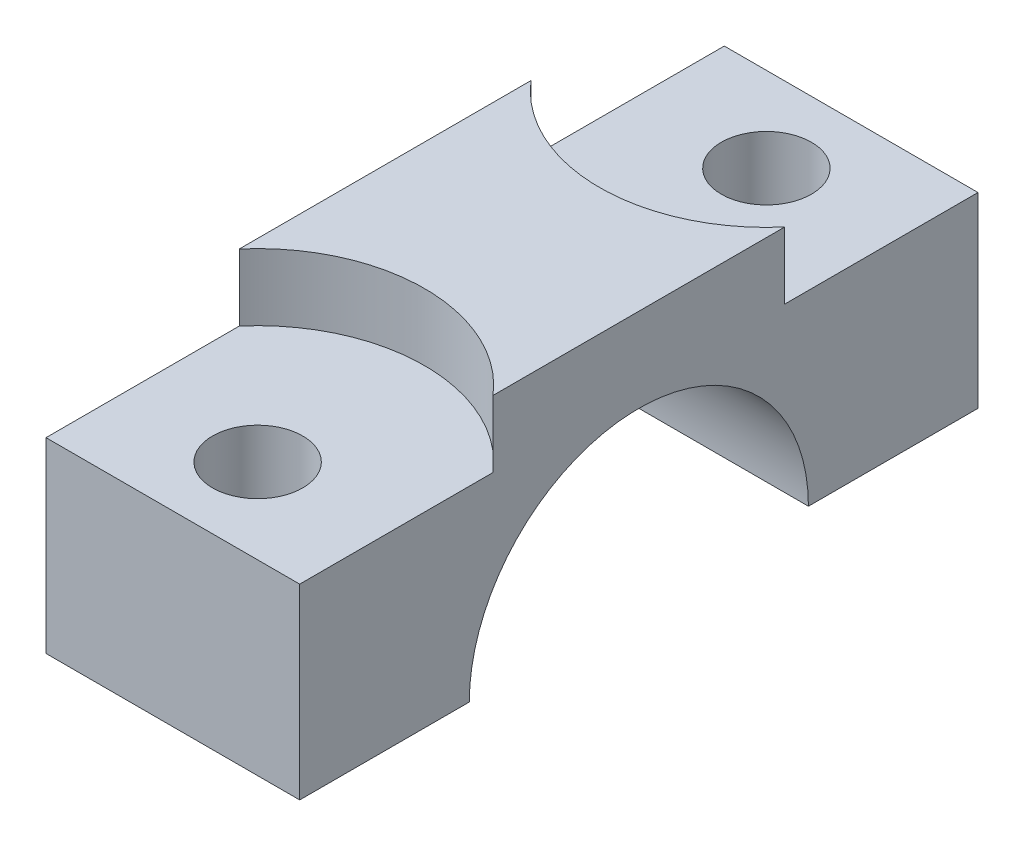
ISO-10303-21;
HEADER;
FILE_DESCRIPTION(('STEP AP214'),'2;1');
FILE_NAME('part.step','',(''),(''),'','','');
FILE_SCHEMA(('AUTOMOTIVE_DESIGN { 1 0 10303 214 1 1 1 1 }'));
ENDSEC;
DATA;
#1=APPLICATION_CONTEXT('core data for automotive mechanical design processes');
#2=APPLICATION_PROTOCOL_DEFINITION('international standard','automotive_design',2000,#1);
#3=PRODUCT_CONTEXT('',#1,'mechanical');
#4=PRODUCT('Part','Part','',(#3));
#5=PRODUCT_RELATED_PRODUCT_CATEGORY('part','',(#4));
#6=PRODUCT_DEFINITION_FORMATION('','',#4);
#7=PRODUCT_DEFINITION_CONTEXT('part definition',#1,'design');
#8=PRODUCT_DEFINITION('design','',#6,#7);
#9=PRODUCT_DEFINITION_SHAPE('','',#8);
#10=(LENGTH_UNIT() NAMED_UNIT(*) SI_UNIT(.MILLI.,.METRE.));
#11=(NAMED_UNIT(*) PLANE_ANGLE_UNIT() SI_UNIT($,.RADIAN.));
#12=(NAMED_UNIT(*) SI_UNIT($,.STERADIAN.) SOLID_ANGLE_UNIT());
#13=UNCERTAINTY_MEASURE_WITH_UNIT(LENGTH_MEASURE(1.E-05),#10,'distance_accuracy_value','');
#14=(GEOMETRIC_REPRESENTATION_CONTEXT(3) GLOBAL_UNCERTAINTY_ASSIGNED_CONTEXT((#13)) GLOBAL_UNIT_ASSIGNED_CONTEXT((#10,
#11,#12)) REPRESENTATION_CONTEXT('',''));
#15=CARTESIAN_POINT('',(0.,0.,0.));
#16=DIRECTION('',(0.,0.,1.));
#17=DIRECTION('',(1.,0.,0.));
#18=AXIS2_PLACEMENT_3D('',#15,#16,#17);
#19=CARTESIAN_POINT('',(9.5,19.,25.4));
#20=DIRECTION('',(0.,-1.,0.));
#21=DIRECTION('',(0.,0.,-1.));
#22=AXIS2_PLACEMENT_3D('',#19,#20,#21);
#23=PLANE('',#22);
#24=CARTESIAN_POINT('',(0.,19.,-19.05));
#25=DIRECTION('',(0.,1.,0.));
#26=DIRECTION('',(0.,0.,1.));
#27=AXIS2_PLACEMENT_3D('',#24,#25,#26);
#28=CIRCLE('',#27,12.5);
#29=CARTESIAN_POINT('',(-9.5,19.,-10.925961595364));
#30=VERTEX_POINT('',#29);
#31=CARTESIAN_POINT('',(9.5,19.,-10.925961595364));
#32=VERTEX_POINT('',#31);
#33=EDGE_CURVE('E121',#30,#32,#28,.T.);
#34=ORIENTED_EDGE('',*,*,#33,.F.);
#35=DIRECTION('',(0.,0.,1.));
#36=VECTOR('',#35,1.);
#37=CARTESIAN_POINT('',(-9.5,19.,25.4));
#38=LINE('',#37,#36);
#39=CARTESIAN_POINT('',(-9.5,19.,10.925961595364));
#40=VERTEX_POINT('',#39);
#41=EDGE_CURVE('E176',#30,#40,#38,.T.);
#42=ORIENTED_EDGE('',*,*,#41,.T.);
#43=CARTESIAN_POINT('',(0.,19.,19.05));
#44=DIRECTION('',(0.,1.,0.));
#45=DIRECTION('',(0.,0.,1.));
#46=AXIS2_PLACEMENT_3D('',#43,#44,#45);
#47=CIRCLE('',#46,12.5);
#48=CARTESIAN_POINT('',(9.5,19.,10.925961595364));
#49=VERTEX_POINT('',#48);
#50=EDGE_CURVE('E143',#49,#40,#47,.T.);
#51=ORIENTED_EDGE('',*,*,#50,.F.);
#52=DIRECTION('',(0.,0.,1.));
#53=VECTOR('',#52,1.);
#54=CARTESIAN_POINT('',(9.5,19.,25.4));
#55=LINE('',#54,#53);
#56=EDGE_CURVE('E187',#32,#49,#55,.T.);
#57=ORIENTED_EDGE('',*,*,#56,.F.);
#58=EDGE_LOOP('',(#34,#42,#51,#57));
#59=FACE_BOUND('',#58,.T.);
#60=ADVANCED_FACE('F43',(#59),#23,.F.);
#61=CARTESIAN_POINT('',(9.5,0.,25.4));
#62=DIRECTION('',(0.,0.,-1.));
#63=DIRECTION('',(-1.,0.,0.));
#64=AXIS2_PLACEMENT_3D('',#61,#62,#63);
#65=PLANE('',#64);
#66=DIRECTION('',(0.,-1.,0.));
#67=VECTOR('',#66,1.);
#68=CARTESIAN_POINT('',(9.5,0.,25.4));
#69=LINE('',#68,#67);
#70=CARTESIAN_POINT('',(9.5,14.,25.4));
#71=VERTEX_POINT('',#70);
#72=CARTESIAN_POINT('',(9.5,0.,25.4));
#73=VERTEX_POINT('',#72);
#74=EDGE_CURVE('E172',#71,#73,#69,.T.);
#75=ORIENTED_EDGE('',*,*,#74,.F.);
#76=DIRECTION('',(-1.,0.,0.));
#77=VECTOR('',#76,1.);
#78=CARTESIAN_POINT('',(9.5,14.,25.4));
#79=LINE('',#78,#77);
#80=CARTESIAN_POINT('',(-9.5,14.,25.4));
#81=VERTEX_POINT('',#80);
#82=EDGE_CURVE('E66',#71,#81,#79,.T.);
#83=ORIENTED_EDGE('',*,*,#82,.T.);
#84=DIRECTION('',(0.,-1.,0.));
#85=VECTOR('',#84,1.);
#86=CARTESIAN_POINT('',(-9.5,0.,25.4));
#87=LINE('',#86,#85);
#88=CARTESIAN_POINT('',(-9.5,0.,25.4));
#89=VERTEX_POINT('',#88);
#90=EDGE_CURVE('E171',#81,#89,#87,.T.);
#91=ORIENTED_EDGE('',*,*,#90,.T.);
#92=DIRECTION('',(-1.,0.,0.));
#93=VECTOR('',#92,1.);
#94=CARTESIAN_POINT('',(9.5,0.,25.4));
#95=LINE('',#94,#93);
#96=EDGE_CURVE('E219',#73,#89,#95,.T.);
#97=ORIENTED_EDGE('',*,*,#96,.F.);
#98=EDGE_LOOP('',(#75,#83,#91,#97));
#99=FACE_BOUND('',#98,.T.);
#100=ADVANCED_FACE('F45',(#99),#65,.F.);
#101=CARTESIAN_POINT('',(9.5,0.,25.4));
#102=DIRECTION('',(0.,1.,0.));
#103=DIRECTION('',(0.,0.,1.));
#104=AXIS2_PLACEMENT_3D('',#101,#102,#103);
#105=PLANE('',#104);
#106=CARTESIAN_POINT('',(0.,0.,19.05));
#107=DIRECTION('',(0.,1.,0.));
#108=DIRECTION('',(0.,0.,1.));
#109=AXIS2_PLACEMENT_3D('',#106,#107,#108);
#110=CIRCLE('',#109,3.375);
#111=CARTESIAN_POINT('',(0.,0.,22.425));
#112=VERTEX_POINT('',#111);
#113=EDGE_CURVE('E159',#112,#112,#110,.T.);
#114=ORIENTED_EDGE('',*,*,#113,.T.);
#115=EDGE_LOOP('',(#114));
#116=FACE_BOUND('',#115,.T.);
#117=DIRECTION('',(0.,0.,-1.));
#118=VECTOR('',#117,1.);
#119=CARTESIAN_POINT('',(-9.5,0.,25.4));
#120=LINE('',#119,#118);
#121=CARTESIAN_POINT('',(-9.5,0.,12.7));
#122=VERTEX_POINT('',#121);
#123=EDGE_CURVE('E193',#89,#122,#120,.T.);
#124=ORIENTED_EDGE('',*,*,#123,.T.);
#125=DIRECTION('',(-1.,0.,0.));
#126=VECTOR('',#125,1.);
#127=CARTESIAN_POINT('',(9.5,0.,12.7));
#128=LINE('',#127,#126);
#129=CARTESIAN_POINT('',(9.5,0.,12.7));
#130=VERTEX_POINT('',#129);
#131=EDGE_CURVE('E215',#130,#122,#128,.T.);
#132=ORIENTED_EDGE('',*,*,#131,.F.);
#133=DIRECTION('',(0.,0.,-1.));
#134=VECTOR('',#133,1.);
#135=CARTESIAN_POINT('',(9.5,0.,25.4));
#136=LINE('',#135,#134);
#137=EDGE_CURVE('E175',#73,#130,#136,.T.);
#138=ORIENTED_EDGE('',*,*,#137,.F.);
#139=ORIENTED_EDGE('',*,*,#96,.T.);
#140=EDGE_LOOP('',(#124,#132,#138,#139));
#141=FACE_BOUND('',#140,.T.);
#142=ADVANCED_FACE('F252',(#116,#141),#105,.F.);
#143=CARTESIAN_POINT('',(9.5,0.,0.));
#144=DIRECTION('',(-1.,0.,0.));
#145=DIRECTION('',(0.,0.,1.));
#146=AXIS2_PLACEMENT_3D('',#143,#144,#145);
#147=CYLINDRICAL_SURFACE('',#146,12.7);
#148=CARTESIAN_POINT('',(-9.5,0.,0.));
#149=DIRECTION('',(-1.,0.,0.));
#150=DIRECTION('',(0.,0.,1.));
#151=AXIS2_PLACEMENT_3D('',#148,#149,#150);
#152=CIRCLE('',#151,12.7);
#153=CARTESIAN_POINT('',(-9.5,0.,-12.7));
#154=VERTEX_POINT('',#153);
#155=EDGE_CURVE('E196',#122,#154,#152,.T.);
#156=ORIENTED_EDGE('',*,*,#155,.T.);
#157=DIRECTION('',(-1.,0.,0.));
#158=VECTOR('',#157,1.);
#159=CARTESIAN_POINT('',(9.5,0.,-12.7));
#160=LINE('',#159,#158);
#161=CARTESIAN_POINT('',(9.5,0.,-12.7));
#162=VERTEX_POINT('',#161);
#163=EDGE_CURVE('E211',#162,#154,#160,.T.);
#164=ORIENTED_EDGE('',*,*,#163,.F.);
#165=CARTESIAN_POINT('',(9.5,0.,0.));
#166=DIRECTION('',(-1.,0.,0.));
#167=DIRECTION('',(0.,0.,1.));
#168=AXIS2_PLACEMENT_3D('',#165,#166,#167);
#169=CIRCLE('',#168,12.7);
#170=EDGE_CURVE('E179',#130,#162,#169,.T.);
#171=ORIENTED_EDGE('',*,*,#170,.F.);
#172=ORIENTED_EDGE('',*,*,#131,.T.);
#173=EDGE_LOOP('',(#156,#164,#171,#172));
#174=FACE_BOUND('',#173,.T.);
#175=ADVANCED_FACE('F259',(#174),#147,.F.);
#176=CARTESIAN_POINT('',(9.5,0.,-12.7));
#177=DIRECTION('',(0.,1.,0.));
#178=DIRECTION('',(0.,0.,1.));
#179=AXIS2_PLACEMENT_3D('',#176,#177,#178);
#180=PLANE('',#179);
#181=CARTESIAN_POINT('',(0.,0.,-19.05));
#182=DIRECTION('',(0.,1.,0.));
#183=DIRECTION('',(0.,0.,1.));
#184=AXIS2_PLACEMENT_3D('',#181,#182,#183);
#185=CIRCLE('',#184,3.375);
#186=CARTESIAN_POINT('',(0.,0.,-15.675));
#187=VERTEX_POINT('',#186);
#188=EDGE_CURVE('E127',#187,#187,#185,.T.);
#189=ORIENTED_EDGE('',*,*,#188,.T.);
#190=EDGE_LOOP('',(#189));
#191=FACE_BOUND('',#190,.T.);
#192=DIRECTION('',(0.,0.,-1.));
#193=VECTOR('',#192,1.);
#194=CARTESIAN_POINT('',(-9.5,0.,-12.7));
#195=LINE('',#194,#193);
#196=CARTESIAN_POINT('',(-9.5,0.,-25.4));
#197=VERTEX_POINT('',#196);
#198=EDGE_CURVE('E199',#154,#197,#195,.T.);
#199=ORIENTED_EDGE('',*,*,#198,.T.);
#200=DIRECTION('',(-1.,0.,0.));
#201=VECTOR('',#200,1.);
#202=CARTESIAN_POINT('',(9.5,0.,-25.4));
#203=LINE('',#202,#201);
#204=CARTESIAN_POINT('',(9.5,0.,-25.4));
#205=VERTEX_POINT('',#204);
#206=EDGE_CURVE('E190',#205,#197,#203,.T.);
#207=ORIENTED_EDGE('',*,*,#206,.F.);
#208=DIRECTION('',(0.,0.,-1.));
#209=VECTOR('',#208,1.);
#210=CARTESIAN_POINT('',(9.5,0.,-12.7));
#211=LINE('',#210,#209);
#212=EDGE_CURVE('E182',#162,#205,#211,.T.);
#213=ORIENTED_EDGE('',*,*,#212,.F.);
#214=ORIENTED_EDGE('',*,*,#163,.T.);
#215=EDGE_LOOP('',(#199,#207,#213,#214));
#216=FACE_BOUND('',#215,.T.);
#217=ADVANCED_FACE('F263',(#191,#216),#180,.F.);
#218=CARTESIAN_POINT('',(9.5,0.,-25.4));
#219=DIRECTION('',(0.,0.,1.));
#220=DIRECTION('',(1.,0.,0.));
#221=AXIS2_PLACEMENT_3D('',#218,#219,#220);
#222=PLANE('',#221);
#223=DIRECTION('',(0.,1.,0.));
#224=VECTOR('',#223,1.);
#225=CARTESIAN_POINT('',(-9.5,0.,-25.4));
#226=LINE('',#225,#224);
#227=CARTESIAN_POINT('',(-9.5,14.,-25.4));
#228=VERTEX_POINT('',#227);
#229=EDGE_CURVE('E202',#197,#228,#226,.T.);
#230=ORIENTED_EDGE('',*,*,#229,.T.);
#231=DIRECTION('',(1.,0.,0.));
#232=VECTOR('',#231,1.);
#233=CARTESIAN_POINT('',(9.5,14.,-25.4));
#234=LINE('',#233,#232);
#235=CARTESIAN_POINT('',(9.5,14.,-25.4));
#236=VERTEX_POINT('',#235);
#237=EDGE_CURVE('E126',#228,#236,#234,.T.);
#238=ORIENTED_EDGE('',*,*,#237,.T.);
#239=DIRECTION('',(0.,1.,0.));
#240=VECTOR('',#239,1.);
#241=CARTESIAN_POINT('',(9.5,0.,-25.4));
#242=LINE('',#241,#240);
#243=EDGE_CURVE('E141',#205,#236,#242,.T.);
#244=ORIENTED_EDGE('',*,*,#243,.F.);
#245=ORIENTED_EDGE('',*,*,#206,.T.);
#246=EDGE_LOOP('',(#230,#238,#244,#245));
#247=FACE_BOUND('',#246,.T.);
#248=ADVANCED_FACE('F266',(#247),#222,.F.);
#249=CARTESIAN_POINT('',(9.5,0.,0.));
#250=DIRECTION('',(-1.,0.,0.));
#251=DIRECTION('',(0.,0.,1.));
#252=AXIS2_PLACEMENT_3D('',#249,#250,#251);
#253=PLANE('',#252);
#254=ORIENTED_EDGE('',*,*,#243,.T.);
#255=DIRECTION('',(0.,0.,1.));
#256=VECTOR('',#255,1.);
#257=CARTESIAN_POINT('',(9.5,14.,0.));
#258=LINE('',#257,#256);
#259=CARTESIAN_POINT('',(9.5,14.,-10.925961595364));
#260=VERTEX_POINT('',#259);
#261=EDGE_CURVE('E131',#236,#260,#258,.T.);
#262=ORIENTED_EDGE('',*,*,#261,.T.);
#263=DIRECTION('',(0.,1.,0.));
#264=VECTOR('',#263,1.);
#265=CARTESIAN_POINT('',(9.5,19.,-10.925961595364));
#266=LINE('',#265,#264);
#267=EDGE_CURVE('E118',#260,#32,#266,.T.);
#268=ORIENTED_EDGE('',*,*,#267,.T.);
#269=ORIENTED_EDGE('',*,*,#56,.T.);
#270=DIRECTION('',(0.,1.,0.));
#271=VECTOR('',#270,1.);
#272=CARTESIAN_POINT('',(9.5,19.,10.925961595364));
#273=LINE('',#272,#271);
#274=CARTESIAN_POINT('',(9.5,14.,10.925961595364));
#275=VERTEX_POINT('',#274);
#276=EDGE_CURVE('E226',#49,#275,#273,.F.);
#277=ORIENTED_EDGE('',*,*,#276,.T.);
#278=DIRECTION('',(0.,0.,1.));
#279=VECTOR('',#278,1.);
#280=CARTESIAN_POINT('',(9.5,14.,0.));
#281=LINE('',#280,#279);
#282=EDGE_CURVE('E223',#275,#71,#281,.T.);
#283=ORIENTED_EDGE('',*,*,#282,.T.);
#284=ORIENTED_EDGE('',*,*,#74,.T.);
#285=ORIENTED_EDGE('',*,*,#137,.T.);
#286=ORIENTED_EDGE('',*,*,#170,.T.);
#287=ORIENTED_EDGE('',*,*,#212,.T.);
#288=EDGE_LOOP('',(#254,#262,#268,#269,#277,#283,#284,#285,#286,#287));
#289=FACE_BOUND('',#288,.T.);
#290=ADVANCED_FACE('F139',(#289),#253,.F.);
#291=CARTESIAN_POINT('',(-9.5,0.,0.));
#292=DIRECTION('',(-1.,0.,0.));
#293=DIRECTION('',(0.,0.,1.));
#294=AXIS2_PLACEMENT_3D('',#291,#292,#293);
#295=PLANE('',#294);
#296=DIRECTION('',(0.,0.,1.));
#297=VECTOR('',#296,1.);
#298=CARTESIAN_POINT('',(-9.5,14.,0.));
#299=LINE('',#298,#297);
#300=CARTESIAN_POINT('',(-9.5,14.,-10.925961595364));
#301=VERTEX_POINT('',#300);
#302=EDGE_CURVE('E11',#228,#301,#299,.T.);
#303=ORIENTED_EDGE('',*,*,#302,.F.);
#304=ORIENTED_EDGE('',*,*,#229,.F.);
#305=ORIENTED_EDGE('',*,*,#198,.F.);
#306=ORIENTED_EDGE('',*,*,#155,.F.);
#307=ORIENTED_EDGE('',*,*,#123,.F.);
#308=ORIENTED_EDGE('',*,*,#90,.F.);
#309=DIRECTION('',(0.,0.,1.));
#310=VECTOR('',#309,1.);
#311=CARTESIAN_POINT('',(-9.5,14.,0.));
#312=LINE('',#311,#310);
#313=CARTESIAN_POINT('',(-9.5,14.,10.925961595364));
#314=VERTEX_POINT('',#313);
#315=EDGE_CURVE('E165',#314,#81,#312,.T.);
#316=ORIENTED_EDGE('',*,*,#315,.F.);
#317=DIRECTION('',(0.,1.,0.));
#318=VECTOR('',#317,1.);
#319=CARTESIAN_POINT('',(-9.5,19.,10.925961595364));
#320=LINE('',#319,#318);
#321=EDGE_CURVE('E168',#40,#314,#320,.F.);
#322=ORIENTED_EDGE('',*,*,#321,.F.);
#323=ORIENTED_EDGE('',*,*,#41,.F.);
#324=DIRECTION('',(0.,1.,0.));
#325=VECTOR('',#324,1.);
#326=CARTESIAN_POINT('',(-9.5,19.,-10.925961595364));
#327=LINE('',#326,#325);
#328=EDGE_CURVE('E52',#301,#30,#327,.T.);
#329=ORIENTED_EDGE('',*,*,#328,.F.);
#330=EDGE_LOOP('',(#303,#304,#305,#306,#307,#308,#316,#322,#323,#329));
#331=FACE_BOUND('',#330,.T.);
#332=ADVANCED_FACE('F237',(#331),#295,.T.);
#333=CARTESIAN_POINT('',(0.,19.,19.05));
#334=DIRECTION('',(0.,1.,0.));
#335=DIRECTION('',(0.,0.,1.));
#336=AXIS2_PLACEMENT_3D('',#333,#334,#335);
#337=CYLINDRICAL_SURFACE('',#336,3.375);
#338=ORIENTED_EDGE('',*,*,#113,.F.);
#339=EDGE_LOOP('',(#338));
#340=FACE_BOUND('',#339,.T.);
#341=CARTESIAN_POINT('',(0.,14.,19.05));
#342=DIRECTION('',(0.,1.,0.));
#343=DIRECTION('',(0.,0.,1.));
#344=AXIS2_PLACEMENT_3D('',#341,#342,#343);
#345=CIRCLE('',#344,3.375);
#346=CARTESIAN_POINT('',(0.,14.,22.425));
#347=VERTEX_POINT('',#346);
#348=EDGE_CURVE('E155',#347,#347,#345,.T.);
#349=ORIENTED_EDGE('',*,*,#348,.T.);
#350=EDGE_LOOP('',(#349));
#351=FACE_BOUND('',#350,.T.);
#352=ADVANCED_FACE('F283',(#340,#351),#337,.F.);
#353=CARTESIAN_POINT('',(3.375,14.,19.05));
#354=DIRECTION('',(0.,-1.,0.));
#355=DIRECTION('',(0.,0.,-1.));
#356=AXIS2_PLACEMENT_3D('',#353,#354,#355);
#357=PLANE('',#356);
#358=ORIENTED_EDGE('',*,*,#315,.T.);
#359=ORIENTED_EDGE('',*,*,#82,.F.);
#360=ORIENTED_EDGE('',*,*,#282,.F.);
#361=CARTESIAN_POINT('',(0.,14.,19.05));
#362=DIRECTION('',(0.,1.,0.));
#363=DIRECTION('',(0.,0.,1.));
#364=AXIS2_PLACEMENT_3D('',#361,#362,#363);
#365=CIRCLE('',#364,12.5);
#366=EDGE_CURVE('E148',#275,#314,#365,.T.);
#367=ORIENTED_EDGE('',*,*,#366,.T.);
#368=EDGE_LOOP('',(#358,#359,#360,#367));
#369=FACE_BOUND('',#368,.T.);
#370=ORIENTED_EDGE('',*,*,#348,.F.);
#371=EDGE_LOOP('',(#370));
#372=FACE_BOUND('',#371,.T.);
#373=ADVANCED_FACE('F244',(#369,#372),#357,.F.);
#374=CARTESIAN_POINT('',(0.,19.,19.05));
#375=DIRECTION('',(0.,1.,0.));
#376=DIRECTION('',(0.,0.,1.));
#377=AXIS2_PLACEMENT_3D('',#374,#375,#376);
#378=CYLINDRICAL_SURFACE('',#377,12.5);
#379=ORIENTED_EDGE('',*,*,#321,.T.);
#380=ORIENTED_EDGE('',*,*,#366,.F.);
#381=ORIENTED_EDGE('',*,*,#276,.F.);
#382=ORIENTED_EDGE('',*,*,#50,.T.);
#383=EDGE_LOOP('',(#379,#380,#381,#382));
#384=FACE_BOUND('',#383,.T.);
#385=ADVANCED_FACE('F242',(#384),#378,.F.);
#386=CARTESIAN_POINT('',(3.375,14.,-19.05));
#387=DIRECTION('',(0.,-1.,0.));
#388=DIRECTION('',(0.,0.,-1.));
#389=AXIS2_PLACEMENT_3D('',#386,#387,#388);
#390=PLANE('',#389);
#391=CARTESIAN_POINT('',(0.,14.,-19.05));
#392=DIRECTION('',(0.,1.,0.));
#393=DIRECTION('',(0.,0.,1.));
#394=AXIS2_PLACEMENT_3D('',#391,#392,#393);
#395=CIRCLE('',#394,3.375);
#396=CARTESIAN_POINT('',(0.,14.,-15.675));
#397=VERTEX_POINT('',#396);
#398=EDGE_CURVE('E136',#397,#397,#395,.T.);
#399=ORIENTED_EDGE('',*,*,#398,.F.);
#400=EDGE_LOOP('',(#399));
#401=FACE_BOUND('',#400,.T.);
#402=ORIENTED_EDGE('',*,*,#237,.F.);
#403=ORIENTED_EDGE('',*,*,#302,.T.);
#404=CARTESIAN_POINT('',(0.,14.,-19.05));
#405=DIRECTION('',(0.,1.,0.));
#406=DIRECTION('',(0.,0.,1.));
#407=AXIS2_PLACEMENT_3D('',#404,#405,#406);
#408=CIRCLE('',#407,12.5);
#409=EDGE_CURVE('E59',#301,#260,#408,.T.);
#410=ORIENTED_EDGE('',*,*,#409,.T.);
#411=ORIENTED_EDGE('',*,*,#261,.F.);
#412=EDGE_LOOP('',(#402,#403,#410,#411));
#413=FACE_BOUND('',#412,.T.);
#414=ADVANCED_FACE('F130',(#401,#413),#390,.F.);
#415=CARTESIAN_POINT('',(0.,19.,-19.05));
#416=DIRECTION('',(0.,1.,0.));
#417=DIRECTION('',(0.,0.,1.));
#418=AXIS2_PLACEMENT_3D('',#415,#416,#417);
#419=CYLINDRICAL_SURFACE('',#418,12.5);
#420=ORIENTED_EDGE('',*,*,#409,.F.);
#421=ORIENTED_EDGE('',*,*,#328,.T.);
#422=ORIENTED_EDGE('',*,*,#33,.T.);
#423=ORIENTED_EDGE('',*,*,#267,.F.);
#424=EDGE_LOOP('',(#420,#421,#422,#423));
#425=FACE_BOUND('',#424,.T.);
#426=ADVANCED_FACE('F119',(#425),#419,.F.);
#427=CARTESIAN_POINT('',(0.,19.,-19.05));
#428=DIRECTION('',(0.,1.,0.));
#429=DIRECTION('',(0.,0.,1.));
#430=AXIS2_PLACEMENT_3D('',#427,#428,#429);
#431=CYLINDRICAL_SURFACE('',#430,3.375);
#432=ORIENTED_EDGE('',*,*,#188,.F.);
#433=EDGE_LOOP('',(#432));
#434=FACE_BOUND('',#433,.T.);
#435=ORIENTED_EDGE('',*,*,#398,.T.);
#436=EDGE_LOOP('',(#435));
#437=FACE_BOUND('',#436,.T.);
#438=ADVANCED_FACE('F292',(#434,#437),#431,.F.);
#439=CLOSED_SHELL('',(#60,#100,#142,#175,#217,#248,#290,#332,#352,#373,#385,#414,#426,#438));
#440=MANIFOLD_SOLID_BREP('B2',#439);
#441=ADVANCED_BREP_SHAPE_REPRESENTATION('',(#18,#440),#14);
#442=SHAPE_DEFINITION_REPRESENTATION(#9,#441);
ENDSEC;
END-ISO-10303-21;
